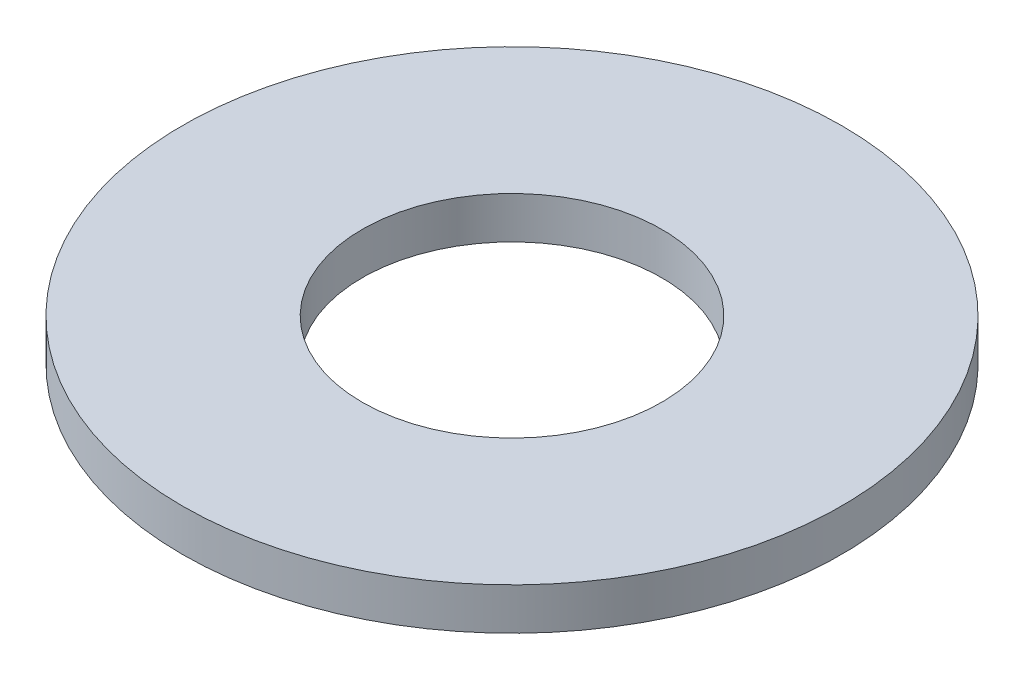
ISO-10303-21;
HEADER;
FILE_DESCRIPTION(('STEP AP214'),'2;1');
FILE_NAME('part.step','',(''),(''),'','','');
FILE_SCHEMA(('AUTOMOTIVE_DESIGN { 1 0 10303 214 1 1 1 1 }'));
ENDSEC;
DATA;
#1=APPLICATION_CONTEXT('core data for automotive mechanical design processes');
#2=APPLICATION_PROTOCOL_DEFINITION('international standard','automotive_design',2000,#1);
#3=PRODUCT_CONTEXT('',#1,'mechanical');
#4=PRODUCT('Part','Part','',(#3));
#5=PRODUCT_RELATED_PRODUCT_CATEGORY('part','',(#4));
#6=PRODUCT_DEFINITION_FORMATION('','',#4);
#7=PRODUCT_DEFINITION_CONTEXT('part definition',#1,'design');
#8=PRODUCT_DEFINITION('design','',#6,#7);
#9=PRODUCT_DEFINITION_SHAPE('','',#8);
#10=(LENGTH_UNIT() NAMED_UNIT(*) SI_UNIT(.MILLI.,.METRE.));
#11=(NAMED_UNIT(*) PLANE_ANGLE_UNIT() SI_UNIT($,.RADIAN.));
#12=(NAMED_UNIT(*) SI_UNIT($,.STERADIAN.) SOLID_ANGLE_UNIT());
#13=UNCERTAINTY_MEASURE_WITH_UNIT(LENGTH_MEASURE(1.E-05),#10,'distance_accuracy_value','');
#14=(GEOMETRIC_REPRESENTATION_CONTEXT(3) GLOBAL_UNCERTAINTY_ASSIGNED_CONTEXT((#13)) GLOBAL_UNIT_ASSIGNED_CONTEXT((#10,
#11,#12)) REPRESENTATION_CONTEXT('',''));
#15=CARTESIAN_POINT('',(0.,0.,0.));
#16=DIRECTION('',(0.,0.,1.));
#17=DIRECTION('',(1.,0.,0.));
#18=AXIS2_PLACEMENT_3D('',#15,#16,#17);
#19=CARTESIAN_POINT('',(0.,7.,0.));
#20=DIRECTION('',(0.,-1.,0.));
#21=DIRECTION('',(0.,0.,-1.));
#22=AXIS2_PLACEMENT_3D('',#19,#20,#21);
#23=CYLINDRICAL_SURFACE('',#22,55.);
#24=CARTESIAN_POINT('',(0.,7.,0.));
#25=DIRECTION('',(0.,1.,0.));
#26=DIRECTION('',(0.,0.,1.));
#27=AXIS2_PLACEMENT_3D('',#24,#25,#26);
#28=CIRCLE('',#27,55.);
#29=CARTESIAN_POINT('',(0.,7.,55.));
#30=VERTEX_POINT('',#29);
#31=EDGE_CURVE('E10',#30,#30,#28,.T.);
#32=ORIENTED_EDGE('',*,*,#31,.F.);
#33=EDGE_LOOP('',(#32));
#34=FACE_BOUND('',#33,.T.);
#35=CARTESIAN_POINT('',(0.,0.,0.));
#36=DIRECTION('',(0.,1.,0.));
#37=DIRECTION('',(0.,0.,1.));
#38=AXIS2_PLACEMENT_3D('',#35,#36,#37);
#39=CIRCLE('',#38,55.);
#40=CARTESIAN_POINT('',(0.,0.,55.));
#41=VERTEX_POINT('',#40);
#42=EDGE_CURVE('E37',#41,#41,#39,.T.);
#43=ORIENTED_EDGE('',*,*,#42,.T.);
#44=EDGE_LOOP('',(#43));
#45=FACE_BOUND('',#44,.T.);
#46=ADVANCED_FACE('F40',(#34,#45),#23,.T.);
#47=CARTESIAN_POINT('',(0.,7.,0.));
#48=DIRECTION('',(0.,1.,0.));
#49=DIRECTION('',(0.,0.,1.));
#50=AXIS2_PLACEMENT_3D('',#47,#48,#49);
#51=PLANE('',#50);
#52=CARTESIAN_POINT('',(0.,7.,0.));
#53=DIRECTION('',(0.,1.,0.));
#54=DIRECTION('',(0.,0.,1.));
#55=AXIS2_PLACEMENT_3D('',#52,#53,#54);
#56=CIRCLE('',#55,25.);
#57=CARTESIAN_POINT('',(0.,7.,25.));
#58=VERTEX_POINT('',#57);
#59=EDGE_CURVE('E50',#58,#58,#56,.T.);
#60=ORIENTED_EDGE('',*,*,#59,.F.);
#61=EDGE_LOOP('',(#60));
#62=FACE_BOUND('',#61,.T.);
#63=ORIENTED_EDGE('',*,*,#31,.T.);
#64=EDGE_LOOP('',(#63));
#65=FACE_BOUND('',#64,.T.);
#66=ADVANCED_FACE('F59',(#62,#65),#51,.T.);
#67=CARTESIAN_POINT('',(0.,0.,0.));
#68=DIRECTION('',(0.,1.,0.));
#69=DIRECTION('',(0.,0.,1.));
#70=AXIS2_PLACEMENT_3D('',#67,#68,#69);
#71=PLANE('',#70);
#72=CARTESIAN_POINT('',(0.,0.,0.));
#73=DIRECTION('',(0.,1.,0.));
#74=DIRECTION('',(0.,0.,1.));
#75=AXIS2_PLACEMENT_3D('',#72,#73,#74);
#76=CIRCLE('',#75,25.);
#77=CARTESIAN_POINT('',(0.,0.,25.));
#78=VERTEX_POINT('',#77);
#79=EDGE_CURVE('E47',#78,#78,#76,.T.);
#80=ORIENTED_EDGE('',*,*,#79,.T.);
#81=EDGE_LOOP('',(#80));
#82=FACE_BOUND('',#81,.T.);
#83=ORIENTED_EDGE('',*,*,#42,.F.);
#84=EDGE_LOOP('',(#83));
#85=FACE_BOUND('',#84,.T.);
#86=ADVANCED_FACE('F58',(#82,#85),#71,.F.);
#87=CARTESIAN_POINT('',(0.,7.,0.));
#88=DIRECTION('',(0.,-1.,0.));
#89=DIRECTION('',(0.,0.,-1.));
#90=AXIS2_PLACEMENT_3D('',#87,#88,#89);
#91=CYLINDRICAL_SURFACE('',#90,25.);
#92=ORIENTED_EDGE('',*,*,#59,.T.);
#93=EDGE_LOOP('',(#92));
#94=FACE_BOUND('',#93,.T.);
#95=ORIENTED_EDGE('',*,*,#79,.F.);
#96=EDGE_LOOP('',(#95));
#97=FACE_BOUND('',#96,.T.);
#98=ADVANCED_FACE('F54',(#94,#97),#91,.F.);
#99=CLOSED_SHELL('',(#46,#66,#86,#98));
#100=MANIFOLD_SOLID_BREP('B2',#99);
#101=ADVANCED_BREP_SHAPE_REPRESENTATION('',(#18,#100),#14);
#102=SHAPE_DEFINITION_REPRESENTATION(#9,#101);
ENDSEC;
END-ISO-10303-21;
